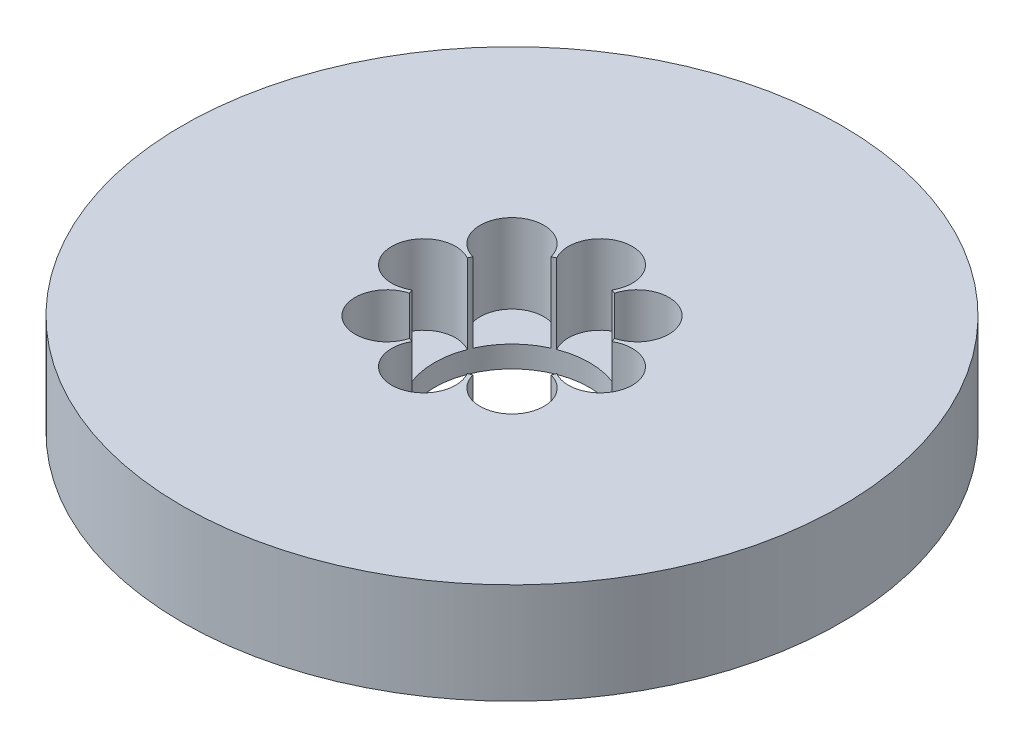
ISO-10303-21;
HEADER;
FILE_DESCRIPTION(('STEP AP214'),'2;1');
FILE_NAME('part.step','',(''),(''),'','','');
FILE_SCHEMA(('AUTOMOTIVE_DESIGN { 1 0 10303 214 1 1 1 1 }'));
ENDSEC;
DATA;
#1=APPLICATION_CONTEXT('core data for automotive mechanical design processes');
#2=APPLICATION_PROTOCOL_DEFINITION('international standard','automotive_design',2000,#1);
#3=PRODUCT_CONTEXT('',#1,'mechanical');
#4=PRODUCT('Part','Part','',(#3));
#5=PRODUCT_RELATED_PRODUCT_CATEGORY('part','',(#4));
#6=PRODUCT_DEFINITION_FORMATION('','',#4);
#7=PRODUCT_DEFINITION_CONTEXT('part definition',#1,'design');
#8=PRODUCT_DEFINITION('design','',#6,#7);
#9=PRODUCT_DEFINITION_SHAPE('','',#8);
#10=(LENGTH_UNIT() NAMED_UNIT(*) SI_UNIT(.MILLI.,.METRE.));
#11=(NAMED_UNIT(*) PLANE_ANGLE_UNIT() SI_UNIT($,.RADIAN.));
#12=(NAMED_UNIT(*) SI_UNIT($,.STERADIAN.) SOLID_ANGLE_UNIT());
#13=UNCERTAINTY_MEASURE_WITH_UNIT(LENGTH_MEASURE(1.E-05),#10,'distance_accuracy_value','');
#14=(GEOMETRIC_REPRESENTATION_CONTEXT(3) GLOBAL_UNCERTAINTY_ASSIGNED_CONTEXT((#13)) GLOBAL_UNIT_ASSIGNED_CONTEXT((#10,
#11,#12)) REPRESENTATION_CONTEXT('',''));
#15=CARTESIAN_POINT('',(0.,0.,0.));
#16=DIRECTION('',(0.,0.,1.));
#17=DIRECTION('',(1.,0.,0.));
#18=AXIS2_PLACEMENT_3D('',#15,#16,#17);
#19=CARTESIAN_POINT('',(0.,13.,0.));
#20=DIRECTION('',(0.,-1.,0.));
#21=DIRECTION('',(0.,0.,-1.));
#22=AXIS2_PLACEMENT_3D('',#19,#20,#21);
#23=CYLINDRICAL_SURFACE('',#22,42.5);
#24=CARTESIAN_POINT('',(0.,13.,0.));
#25=DIRECTION('',(0.,1.,0.));
#26=DIRECTION('',(0.,0.,1.));
#27=AXIS2_PLACEMENT_3D('',#24,#25,#26);
#28=CIRCLE('',#27,42.5);
#29=CARTESIAN_POINT('',(0.,13.,-42.5));
#30=VERTEX_POINT('',#29);
#31=EDGE_CURVE('E194',#30,#30,#28,.T.);
#32=CARTESIAN_POINT('',(0.,0.,0.));
#33=DIRECTION('',(0.,1.,0.));
#34=DIRECTION('',(0.,0.,1.));
#35=AXIS2_PLACEMENT_3D('',#32,#33,#34);
#36=CIRCLE('',#35,42.5);
#37=CARTESIAN_POINT('',(0.,0.,-42.5));
#38=VERTEX_POINT('',#37);
#39=EDGE_CURVE('E181',#38,#38,#36,.T.);
#40=CARTESIAN_POINT('',(0.,13.,-42.5));
#41=CARTESIAN_POINT('',(0.,12.8645833333333,-42.5));
#42=CARTESIAN_POINT('',(0.,12.7291666666667,-42.5));
#43=CARTESIAN_POINT('',(0.,12.4583333333333,-42.5));
#44=CARTESIAN_POINT('',(0.,12.3229166666667,-42.5));
#45=CARTESIAN_POINT('',(0.,12.0520833333333,-42.5));
#46=CARTESIAN_POINT('',(0.,11.9166666666667,-42.5));
#47=CARTESIAN_POINT('',(0.,11.6458333333333,-42.5));
#48=CARTESIAN_POINT('',(0.,11.5104166666667,-42.5));
#49=CARTESIAN_POINT('',(0.,11.2395833333333,-42.5));
#50=CARTESIAN_POINT('',(0.,11.1041666666667,-42.5));
#51=CARTESIAN_POINT('',(0.,10.8333333333333,-42.5));
#52=CARTESIAN_POINT('',(0.,10.6979166666667,-42.5));
#53=CARTESIAN_POINT('',(0.,10.4270833333333,-42.5));
#54=CARTESIAN_POINT('',(0.,10.2916666666667,-42.5));
#55=CARTESIAN_POINT('',(0.,10.0208333333333,-42.5));
#56=CARTESIAN_POINT('',(0.,9.88541666666667,-42.5));
#57=CARTESIAN_POINT('',(0.,9.61458333333333,-42.5));
#58=CARTESIAN_POINT('',(0.,9.47916666666667,-42.5));
#59=CARTESIAN_POINT('',(0.,9.20833333333333,-42.5));
#60=CARTESIAN_POINT('',(0.,9.07291666666666,-42.5));
#61=CARTESIAN_POINT('',(0.,8.80208333333333,-42.5));
#62=CARTESIAN_POINT('',(0.,8.66666666666667,-42.5));
#63=CARTESIAN_POINT('',(0.,8.39583333333333,-42.5));
#64=CARTESIAN_POINT('',(0.,8.26041666666667,-42.5));
#65=CARTESIAN_POINT('',(0.,7.98958333333333,-42.5));
#66=CARTESIAN_POINT('',(0.,7.85416666666667,-42.5));
#67=CARTESIAN_POINT('',(0.,7.58333333333333,-42.5));
#68=CARTESIAN_POINT('',(0.,7.44791666666667,-42.5));
#69=CARTESIAN_POINT('',(0.,7.17708333333333,-42.5));
#70=CARTESIAN_POINT('',(0.,7.04166666666667,-42.5));
#71=CARTESIAN_POINT('',(0.,6.77083333333333,-42.5));
#72=CARTESIAN_POINT('',(0.,6.63541666666667,-42.5));
#73=CARTESIAN_POINT('',(0.,6.36458333333333,-42.5));
#74=CARTESIAN_POINT('',(0.,6.22916666666667,-42.5));
#75=CARTESIAN_POINT('',(0.,5.95833333333333,-42.5));
#76=CARTESIAN_POINT('',(0.,5.82291666666667,-42.5));
#77=CARTESIAN_POINT('',(0.,5.55208333333333,-42.5));
#78=CARTESIAN_POINT('',(0.,5.41666666666667,-42.5));
#79=CARTESIAN_POINT('',(0.,5.14583333333333,-42.5));
#80=CARTESIAN_POINT('',(0.,5.01041666666667,-42.5));
#81=CARTESIAN_POINT('',(0.,4.73958333333333,-42.5));
#82=CARTESIAN_POINT('',(0.,4.60416666666667,-42.5));
#83=CARTESIAN_POINT('',(0.,4.33333333333333,-42.5));
#84=CARTESIAN_POINT('',(0.,4.19791666666667,-42.5));
#85=CARTESIAN_POINT('',(0.,3.92708333333333,-42.5));
#86=CARTESIAN_POINT('',(0.,3.79166666666667,-42.5));
#87=CARTESIAN_POINT('',(0.,3.52083333333333,-42.5));
#88=CARTESIAN_POINT('',(0.,3.38541666666667,-42.5));
#89=CARTESIAN_POINT('',(0.,3.11458333333333,-42.5));
#90=CARTESIAN_POINT('',(0.,2.97916666666667,-42.5));
#91=CARTESIAN_POINT('',(0.,2.70833333333333,-42.5));
#92=CARTESIAN_POINT('',(0.,2.57291666666667,-42.5));
#93=CARTESIAN_POINT('',(0.,2.30208333333333,-42.5));
#94=CARTESIAN_POINT('',(0.,2.16666666666667,-42.5));
#95=CARTESIAN_POINT('',(0.,1.89583333333333,-42.5));
#96=CARTESIAN_POINT('',(0.,1.76041666666667,-42.5));
#97=CARTESIAN_POINT('',(0.,1.48958333333333,-42.5));
#98=CARTESIAN_POINT('',(0.,1.35416666666667,-42.5));
#99=CARTESIAN_POINT('',(0.,1.08333333333333,-42.5));
#100=CARTESIAN_POINT('',(0.,0.947916666666667,-42.5));
#101=CARTESIAN_POINT('',(0.,0.677083333333334,-42.5));
#102=CARTESIAN_POINT('',(0.,0.541666666666667,-42.5));
#103=CARTESIAN_POINT('',(0.,0.270833333333334,-42.5));
#104=CARTESIAN_POINT('',(0.,0.135416666666667,-42.5));
#105=CARTESIAN_POINT('',(0.,0.,-42.5));
#106=B_SPLINE_CURVE_WITH_KNOTS('',3,(#40,#41,#42,#43,#44,#45,#46,#47,#48,#49,#50,#51,#52,#53,
#54,#55,#56,#57,#58,#59,#60,#61,#62,#63,#64,#65,#66,#67,#68,#69,#70,#71,#72,#73,#74,#75,#76,#77,
#78,#79,#80,#81,#82,#83,#84,#85,#86,#87,#88,#89,#90,#91,#92,#93,#94,#95,#96,#97,#98,#99,#100,
#101,#102,#103,#104,#105),.UNSPECIFIED.,.F.,.F.,(4,2,2,2,2,2,2,2,2,2,2,2,2,2,2,2,2,2,2,2,2,2,2,
2,2,2,2,2,2,2,2,2,4),(0.,0.40625,0.812500000000001,1.21875,1.625,2.03125,2.4375,2.84375,3.25,
3.65625,4.0625,4.46875,4.875,5.28125,5.6875,6.09375,6.5,6.90625,7.3125,7.71875,8.125,8.53125,
8.9375,9.34375,9.75,10.15625,10.5625,10.96875,11.375,11.78125,12.1875,12.59375,13.),.UNSPECIFIED.);
#107=EDGE_CURVE('BSEAM39',#30,#38,#106,.T.);
#108=ORIENTED_EDGE('',*,*,#31,.F.);
#109=ORIENTED_EDGE('',*,*,#39,.T.);
#110=ORIENTED_EDGE('',*,*,#107,.T.);
#111=ORIENTED_EDGE('',*,*,#107,.F.);
#112=EDGE_LOOP('',(#108,#110,#109,#111));
#113=FACE_BOUND('',#112,.T.);
#114=ADVANCED_FACE('F39',(#113),#23,.T.);
#115=CARTESIAN_POINT('',(0.,13.,0.));
#116=DIRECTION('',(0.,1.,0.));
#117=DIRECTION('',(0.,0.,1.));
#118=AXIS2_PLACEMENT_3D('',#115,#116,#117);
#119=PLANE('',#118);
#120=CARTESIAN_POINT('',(11.3924649321803,13.,0.));
#121=DIRECTION('',(0.,1.,0.));
#122=DIRECTION('',(0.,0.,-1.));
#123=AXIS2_PLACEMENT_3D('',#120,#121,#122);
#124=CIRCLE('',#123,4.11995132108615);
#125=CARTESIAN_POINT('',(9.34013225450894,13.,3.57238428339977));
#126=VERTEX_POINT('',#125);
#127=CARTESIAN_POINT('',(9.34013225450894,13.,-3.57238428339977));
#128=VERTEX_POINT('',#127);
#129=EDGE_CURVE('E254',#126,#128,#124,.T.);
#130=ORIENTED_EDGE('',*,*,#129,.F.);
#131=CARTESIAN_POINT('',(0.,13.,0.));
#132=DIRECTION('',(0.,1.,0.));
#133=DIRECTION('',(0.,0.,1.));
#134=AXIS2_PLACEMENT_3D('',#131,#132,#133);
#135=CIRCLE('',#134,10.);
#136=CARTESIAN_POINT('',(9.13052800613871,13.,4.0784137025462));
#137=VERTEX_POINT('',#136);
#138=EDGE_CURVE('E186',#137,#126,#135,.T.);
#139=ORIENTED_EDGE('',*,*,#138,.F.);
#140=CARTESIAN_POINT('',(8.05568920797469,13.,8.05568920797461));
#141=DIRECTION('',(0.,1.,0.));
#142=DIRECTION('',(0.707106781186544,0.,-0.707106781186551));
#143=AXIS2_PLACEMENT_3D('',#140,#141,#142);
#144=CIRCLE('',#143,4.11995132108615);
#145=CARTESIAN_POINT('',(4.0784137025463,13.,9.13052800613867));
#146=VERTEX_POINT('',#145);
#147=EDGE_CURVE('E323',#146,#137,#144,.T.);
#148=ORIENTED_EDGE('',*,*,#147,.F.);
#149=CARTESIAN_POINT('',(3.5723842833998,13.,9.34013225450893));
#150=VERTEX_POINT('',#149);
#151=EDGE_CURVE('E182',#150,#146,#135,.T.);
#152=ORIENTED_EDGE('',*,*,#151,.F.);
#153=CARTESIAN_POINT('',(0.,13.,11.3924649321803));
#154=DIRECTION('',(0.,1.,0.));
#155=DIRECTION('',(1.,0.,0.));
#156=AXIS2_PLACEMENT_3D('',#153,#154,#155);
#157=CIRCLE('',#156,4.11995132108615);
#158=CARTESIAN_POINT('',(-3.57238428339974,13.,9.34013225450895));
#159=VERTEX_POINT('',#158);
#160=EDGE_CURVE('E178',#159,#150,#157,.T.);
#161=ORIENTED_EDGE('',*,*,#160,.F.);
#162=CARTESIAN_POINT('',(-4.07841370254623,13.,9.1305280061387));
#163=VERTEX_POINT('',#162);
#164=EDGE_CURVE('E171',#163,#159,#135,.T.);
#165=ORIENTED_EDGE('',*,*,#164,.F.);
#166=CARTESIAN_POINT('',(-8.05568920797464,13.,8.05568920797466));
#167=DIRECTION('',(0.,1.,0.));
#168=DIRECTION('',(0.707106781186549,0.,0.707106781186546));
#169=AXIS2_PLACEMENT_3D('',#166,#167,#168);
#170=CIRCLE('',#169,4.11995132108615);
#171=CARTESIAN_POINT('',(-9.13052800613869,13.,4.07841370254626));
#172=VERTEX_POINT('',#171);
#173=EDGE_CURVE('E147',#172,#163,#170,.T.);
#174=ORIENTED_EDGE('',*,*,#173,.F.);
#175=CARTESIAN_POINT('',(-9.34013225450894,13.,3.57238428339977));
#176=VERTEX_POINT('',#175);
#177=EDGE_CURVE('E179',#176,#172,#135,.T.);
#178=ORIENTED_EDGE('',*,*,#177,.F.);
#179=CARTESIAN_POINT('',(-11.3924649321803,13.,0.));
#180=DIRECTION('',(0.,1.,0.));
#181=DIRECTION('',(0.,0.,1.));
#182=AXIS2_PLACEMENT_3D('',#179,#180,#181);
#183=CIRCLE('',#182,4.11995132108615);
#184=CARTESIAN_POINT('',(-9.34013225450894,13.,-3.57238428339977));
#185=VERTEX_POINT('',#184);
#186=EDGE_CURVE('E188',#185,#176,#183,.T.);
#187=ORIENTED_EDGE('',*,*,#186,.F.);
#188=CARTESIAN_POINT('',(-9.13052800613874,13.,-4.07841370254614));
#189=VERTEX_POINT('',#188);
#190=EDGE_CURVE('E184',#189,#185,#135,.T.);
#191=ORIENTED_EDGE('',*,*,#190,.F.);
#192=CARTESIAN_POINT('',(-8.05568920797475,13.,-8.05568920797455));
#193=DIRECTION('',(0.,1.,0.));
#194=DIRECTION('',(-0.707106781186539,0.,0.707106781186556));
#195=AXIS2_PLACEMENT_3D('',#192,#193,#194);
#196=CIRCLE('',#195,4.11995132108615);
#197=CARTESIAN_POINT('',(-4.07841370254636,13.,-9.13052800613864));
#198=VERTEX_POINT('',#197);
#199=EDGE_CURVE('E368',#198,#189,#196,.T.);
#200=ORIENTED_EDGE('',*,*,#199,.F.);
#201=CARTESIAN_POINT('',(-3.57238428339987,13.,-9.34013225450891));
#202=VERTEX_POINT('',#201);
#203=EDGE_CURVE('E345',#202,#198,#135,.T.);
#204=ORIENTED_EDGE('',*,*,#203,.F.);
#205=CARTESIAN_POINT('',(-1.19329736142397E-13,13.,-11.3924649321803));
#206=DIRECTION('',(0.,1.,0.));
#207=DIRECTION('',(-1.,0.,0.));
#208=AXIS2_PLACEMENT_3D('',#205,#206,#207);
#209=CIRCLE('',#208,4.11995132108615);
#210=CARTESIAN_POINT('',(3.57238428339967,13.,-9.34013225450898));
#211=VERTEX_POINT('',#210);
#212=EDGE_CURVE('E363',#211,#202,#209,.T.);
#213=ORIENTED_EDGE('',*,*,#212,.F.);
#214=CARTESIAN_POINT('',(4.07841370254617,13.,-9.13052800613873));
#215=VERTEX_POINT('',#214);
#216=EDGE_CURVE('E343',#215,#211,#135,.T.);
#217=ORIENTED_EDGE('',*,*,#216,.F.);
#218=CARTESIAN_POINT('',(8.05568920797458,13.,-8.05568920797472));
#219=DIRECTION('',(0.,1.,0.));
#220=DIRECTION('',(-0.707106781186554,0.,-0.707106781186541));
#221=AXIS2_PLACEMENT_3D('',#218,#219,#220);
#222=CIRCLE('',#221,4.11995132108615);
#223=CARTESIAN_POINT('',(9.13052800613866,13.,-4.07841370254633));
#224=VERTEX_POINT('',#223);
#225=EDGE_CURVE('E354',#224,#215,#222,.T.);
#226=ORIENTED_EDGE('',*,*,#225,.F.);
#227=EDGE_CURVE('E349',#128,#224,#135,.T.);
#228=ORIENTED_EDGE('',*,*,#227,.F.);
#229=EDGE_LOOP('',(#130,#139,#148,#152,#161,#165,#174,#178,#187,#191,#200,#204,#213,#217,#226,#228));
#230=FACE_BOUND('',#229,.T.);
#231=ORIENTED_EDGE('',*,*,#31,.T.);
#232=EDGE_LOOP('',(#231));
#233=FACE_BOUND('',#232,.T.);
#234=ADVANCED_FACE('F176',(#230,#233),#119,.T.);
#235=CARTESIAN_POINT('',(0.,0.,0.));
#236=DIRECTION('',(0.,1.,0.));
#237=DIRECTION('',(0.,0.,1.));
#238=AXIS2_PLACEMENT_3D('',#235,#236,#237);
#239=PLANE('',#238);
#240=CARTESIAN_POINT('',(0.,0.,0.));
#241=DIRECTION('',(0.,1.,0.));
#242=DIRECTION('',(0.,0.,1.));
#243=AXIS2_PLACEMENT_3D('',#240,#241,#242);
#244=CIRCLE('',#243,10.);
#245=CARTESIAN_POINT('',(0.,0.,10.));
#246=VERTEX_POINT('',#245);
#247=EDGE_CURVE('E191',#246,#246,#244,.T.);
#248=ORIENTED_EDGE('',*,*,#247,.T.);
#249=EDGE_LOOP('',(#248));
#250=FACE_BOUND('',#249,.T.);
#251=ORIENTED_EDGE('',*,*,#39,.F.);
#252=EDGE_LOOP('',(#251));
#253=FACE_BOUND('',#252,.T.);
#254=ADVANCED_FACE('F273',(#250,#253),#239,.F.);
#255=CARTESIAN_POINT('',(0.,13.,0.));
#256=DIRECTION('',(0.,-1.,0.));
#257=DIRECTION('',(0.,0.,-1.));
#258=AXIS2_PLACEMENT_3D('',#255,#256,#257);
#259=CYLINDRICAL_SURFACE('',#258,10.);
#260=DIRECTION('',(0.,1.,0.));
#261=VECTOR('',#260,1.);
#262=CARTESIAN_POINT('',(9.34013225450894,7.89036313454172,3.57238428339977));
#263=LINE('',#262,#261);
#264=CARTESIAN_POINT('',(9.34013225450894,2.78072626908345,3.57238428339977));
#265=VERTEX_POINT('',#264);
#266=EDGE_CURVE('E11',#265,#126,#263,.T.);
#267=ORIENTED_EDGE('',*,*,#266,.F.);
#268=CARTESIAN_POINT('',(0.,2.78072626908345,0.));
#269=DIRECTION('',(0.,1.,0.));
#270=DIRECTION('',(0.,0.,1.));
#271=AXIS2_PLACEMENT_3D('',#268,#269,#270);
#272=CIRCLE('',#271,10.);
#273=CARTESIAN_POINT('',(9.34013225450894,2.78072626908345,-3.57238428339977));
#274=VERTEX_POINT('',#273);
#275=EDGE_CURVE('E249',#265,#274,#272,.T.);
#276=ORIENTED_EDGE('',*,*,#275,.T.);
#277=DIRECTION('',(0.,1.,0.));
#278=VECTOR('',#277,1.);
#279=CARTESIAN_POINT('',(9.34013225450894,7.89036313454172,-3.57238428339977));
#280=LINE('',#279,#278);
#281=EDGE_CURVE('E46',#128,#274,#280,.F.);
#282=ORIENTED_EDGE('',*,*,#281,.F.);
#283=ORIENTED_EDGE('',*,*,#227,.T.);
#284=DIRECTION('',(0.,1.,0.));
#285=VECTOR('',#284,1.);
#286=CARTESIAN_POINT('',(9.13052800613866,7.89036313454172,-4.07841370254633));
#287=LINE('',#286,#285);
#288=CARTESIAN_POINT('',(9.13052800613866,2.78072626908345,-4.07841370254633));
#289=VERTEX_POINT('',#288);
#290=EDGE_CURVE('E247',#289,#224,#287,.T.);
#291=ORIENTED_EDGE('',*,*,#290,.F.);
#292=CARTESIAN_POINT('',(0.,2.78072626908345,0.));
#293=DIRECTION('',(0.,1.,0.));
#294=DIRECTION('',(0.,0.,1.));
#295=AXIS2_PLACEMENT_3D('',#292,#293,#294);
#296=CIRCLE('',#295,10.);
#297=CARTESIAN_POINT('',(4.07841370254617,2.78072626908345,-9.13052800613873));
#298=VERTEX_POINT('',#297);
#299=EDGE_CURVE('E242',#289,#298,#296,.T.);
#300=ORIENTED_EDGE('',*,*,#299,.T.);
#301=DIRECTION('',(0.,1.,0.));
#302=VECTOR('',#301,1.);
#303=CARTESIAN_POINT('',(4.07841370254617,7.89036313454172,-9.13052800613873));
#304=LINE('',#303,#302);
#305=EDGE_CURVE('E246',#215,#298,#304,.F.);
#306=ORIENTED_EDGE('',*,*,#305,.F.);
#307=ORIENTED_EDGE('',*,*,#216,.T.);
#308=DIRECTION('',(0.,1.,0.));
#309=VECTOR('',#308,1.);
#310=CARTESIAN_POINT('',(3.57238428339967,7.89036313454172,-9.34013225450898));
#311=LINE('',#310,#309);
#312=CARTESIAN_POINT('',(3.57238428339967,2.78072626908345,-9.34013225450898));
#313=VERTEX_POINT('',#312);
#314=EDGE_CURVE('E220',#313,#211,#311,.T.);
#315=ORIENTED_EDGE('',*,*,#314,.F.);
#316=CARTESIAN_POINT('',(0.,2.78072626908345,0.));
#317=DIRECTION('',(0.,1.,0.));
#318=DIRECTION('',(0.,0.,1.));
#319=AXIS2_PLACEMENT_3D('',#316,#317,#318);
#320=CIRCLE('',#319,10.);
#321=CARTESIAN_POINT('',(-3.57238428339987,2.78072626908345,-9.34013225450891));
#322=VERTEX_POINT('',#321);
#323=EDGE_CURVE('E211',#313,#322,#320,.T.);
#324=ORIENTED_EDGE('',*,*,#323,.T.);
#325=DIRECTION('',(0.,1.,0.));
#326=VECTOR('',#325,1.);
#327=CARTESIAN_POINT('',(-3.57238428339987,7.89036313454172,-9.34013225450891));
#328=LINE('',#327,#326);
#329=EDGE_CURVE('E212',#202,#322,#328,.F.);
#330=ORIENTED_EDGE('',*,*,#329,.F.);
#331=ORIENTED_EDGE('',*,*,#203,.T.);
#332=DIRECTION('',(0.,1.,0.));
#333=VECTOR('',#332,1.);
#334=CARTESIAN_POINT('',(-4.07841370254636,7.89036313454172,-9.13052800613864));
#335=LINE('',#334,#333);
#336=CARTESIAN_POINT('',(-4.07841370254636,2.78072626908345,-9.13052800613864));
#337=VERTEX_POINT('',#336);
#338=EDGE_CURVE('E223',#337,#198,#335,.T.);
#339=ORIENTED_EDGE('',*,*,#338,.F.);
#340=CARTESIAN_POINT('',(0.,2.78072626908345,0.));
#341=DIRECTION('',(0.,1.,0.));
#342=DIRECTION('',(0.,0.,1.));
#343=AXIS2_PLACEMENT_3D('',#340,#341,#342);
#344=CIRCLE('',#343,10.);
#345=CARTESIAN_POINT('',(-9.13052800613874,2.78072626908345,-4.07841370254614));
#346=VERTEX_POINT('',#345);
#347=EDGE_CURVE('E218',#337,#346,#344,.T.);
#348=ORIENTED_EDGE('',*,*,#347,.T.);
#349=DIRECTION('',(0.,1.,0.));
#350=VECTOR('',#349,1.);
#351=CARTESIAN_POINT('',(-9.13052800613874,7.89036313454172,-4.07841370254614));
#352=LINE('',#351,#350);
#353=EDGE_CURVE('E225',#189,#346,#352,.F.);
#354=ORIENTED_EDGE('',*,*,#353,.F.);
#355=ORIENTED_EDGE('',*,*,#190,.T.);
#356=DIRECTION('',(0.,1.,0.));
#357=VECTOR('',#356,1.);
#358=CARTESIAN_POINT('',(-9.34013225450894,7.89036313454172,-3.57238428339977));
#359=LINE('',#358,#357);
#360=CARTESIAN_POINT('',(-9.34013225450894,2.78072626908345,-3.57238428339977));
#361=VERTEX_POINT('',#360);
#362=EDGE_CURVE('E206',#361,#185,#359,.T.);
#363=ORIENTED_EDGE('',*,*,#362,.F.);
#364=CARTESIAN_POINT('',(0.,2.78072626908345,0.));
#365=DIRECTION('',(0.,1.,0.));
#366=DIRECTION('',(0.,0.,1.));
#367=AXIS2_PLACEMENT_3D('',#364,#365,#366);
#368=CIRCLE('',#367,10.);
#369=CARTESIAN_POINT('',(-9.34013225450894,2.78072626908345,3.57238428339977));
#370=VERTEX_POINT('',#369);
#371=EDGE_CURVE('E196',#361,#370,#368,.T.);
#372=ORIENTED_EDGE('',*,*,#371,.T.);
#373=DIRECTION('',(0.,1.,0.));
#374=VECTOR('',#373,1.);
#375=CARTESIAN_POINT('',(-9.34013225450894,7.89036313454172,3.57238428339977));
#376=LINE('',#375,#374);
#377=EDGE_CURVE('E201',#176,#370,#376,.F.);
#378=ORIENTED_EDGE('',*,*,#377,.F.);
#379=ORIENTED_EDGE('',*,*,#177,.T.);
#380=DIRECTION('',(0.,1.,0.));
#381=VECTOR('',#380,1.);
#382=CARTESIAN_POINT('',(-9.13052800613869,7.89036313454172,4.07841370254627));
#383=LINE('',#382,#381);
#384=CARTESIAN_POINT('',(-9.13052800613869,2.78072626908345,4.07841370254626));
#385=VERTEX_POINT('',#384);
#386=EDGE_CURVE('E160',#385,#172,#383,.T.);
#387=ORIENTED_EDGE('',*,*,#386,.F.);
#388=CARTESIAN_POINT('',(0.,2.78072626908345,0.));
#389=DIRECTION('',(0.,1.,0.));
#390=DIRECTION('',(0.,0.,1.));
#391=AXIS2_PLACEMENT_3D('',#388,#389,#390);
#392=CIRCLE('',#391,10.);
#393=CARTESIAN_POINT('',(-4.07841370254623,2.78072626908345,9.1305280061387));
#394=VERTEX_POINT('',#393);
#395=EDGE_CURVE('E175',#385,#394,#392,.T.);
#396=ORIENTED_EDGE('',*,*,#395,.T.);
#397=DIRECTION('',(0.,1.,0.));
#398=VECTOR('',#397,1.);
#399=CARTESIAN_POINT('',(-4.07841370254623,7.89036313454172,9.1305280061387));
#400=LINE('',#399,#398);
#401=EDGE_CURVE('E152',#163,#394,#400,.F.);
#402=ORIENTED_EDGE('',*,*,#401,.F.);
#403=ORIENTED_EDGE('',*,*,#164,.T.);
#404=DIRECTION('',(0.,1.,0.));
#405=VECTOR('',#404,1.);
#406=CARTESIAN_POINT('',(-3.57238428339974,7.89036313454172,9.34013225450896));
#407=LINE('',#406,#405);
#408=CARTESIAN_POINT('',(-3.57238428339974,2.78072626908345,9.34013225450895));
#409=VERTEX_POINT('',#408);
#410=EDGE_CURVE('E241',#409,#159,#407,.T.);
#411=ORIENTED_EDGE('',*,*,#410,.F.);
#412=CARTESIAN_POINT('',(0.,2.78072626908345,0.));
#413=DIRECTION('',(0.,1.,0.));
#414=DIRECTION('',(0.,0.,1.));
#415=AXIS2_PLACEMENT_3D('',#412,#413,#414);
#416=CIRCLE('',#415,10.);
#417=CARTESIAN_POINT('',(3.5723842833998,2.78072626908345,9.34013225450893));
#418=VERTEX_POINT('',#417);
#419=EDGE_CURVE('E234',#409,#418,#416,.T.);
#420=ORIENTED_EDGE('',*,*,#419,.T.);
#421=DIRECTION('',(0.,1.,0.));
#422=VECTOR('',#421,1.);
#423=CARTESIAN_POINT('',(3.5723842833998,7.89036313454172,9.34013225450893));
#424=LINE('',#423,#422);
#425=EDGE_CURVE('E236',#150,#418,#424,.F.);
#426=ORIENTED_EDGE('',*,*,#425,.F.);
#427=ORIENTED_EDGE('',*,*,#151,.T.);
#428=DIRECTION('',(0.,1.,0.));
#429=VECTOR('',#428,1.);
#430=CARTESIAN_POINT('',(4.0784137025463,7.89036313454172,9.13052800613867));
#431=LINE('',#430,#429);
#432=CARTESIAN_POINT('',(4.0784137025463,2.78072626908345,9.13052800613867));
#433=VERTEX_POINT('',#432);
#434=EDGE_CURVE('E232',#433,#146,#431,.T.);
#435=ORIENTED_EDGE('',*,*,#434,.F.);
#436=CARTESIAN_POINT('',(0.,2.78072626908345,0.));
#437=DIRECTION('',(0.,1.,0.));
#438=DIRECTION('',(0.,0.,1.));
#439=AXIS2_PLACEMENT_3D('',#436,#437,#438);
#440=CIRCLE('',#439,10.);
#441=CARTESIAN_POINT('',(9.13052800613871,2.78072626908345,4.0784137025462));
#442=VERTEX_POINT('',#441);
#443=EDGE_CURVE('E230',#433,#442,#440,.T.);
#444=ORIENTED_EDGE('',*,*,#443,.T.);
#445=DIRECTION('',(0.,1.,0.));
#446=VECTOR('',#445,1.);
#447=CARTESIAN_POINT('',(9.13052800613871,7.89036313454172,4.0784137025462));
#448=LINE('',#447,#446);
#449=EDGE_CURVE('E229',#137,#442,#448,.F.);
#450=ORIENTED_EDGE('',*,*,#449,.F.);
#451=ORIENTED_EDGE('',*,*,#138,.T.);
#452=EDGE_LOOP('',(#267,#276,#282,#283,#291,#300,#306,#307,#315,#324,#330,#331,#339,#348,#354,
#355,#363,#372,#378,#379,#387,#396,#402,#403,#411,#420,#426,#427,#435,#444,#450,#451));
#453=FACE_BOUND('',#452,.T.);
#454=ORIENTED_EDGE('',*,*,#247,.F.);
#455=EDGE_LOOP('',(#454));
#456=FACE_BOUND('',#455,.T.);
#457=ADVANCED_FACE('F169',(#453,#456),#259,.F.);
#458=CARTESIAN_POINT('',(-11.3924649321803,2.78072626908345,0.));
#459=DIRECTION('',(0.,1.,0.));
#460=DIRECTION('',(0.,0.,1.));
#461=AXIS2_PLACEMENT_3D('',#458,#459,#460);
#462=CYLINDRICAL_SURFACE('',#461,4.11995132108615);
#463=ORIENTED_EDGE('',*,*,#362,.T.);
#464=ORIENTED_EDGE('',*,*,#186,.T.);
#465=ORIENTED_EDGE('',*,*,#377,.T.);
#466=CARTESIAN_POINT('',(-11.3924649321803,2.78072626908345,0.));
#467=DIRECTION('',(0.,1.,0.));
#468=DIRECTION('',(0.,0.,1.));
#469=AXIS2_PLACEMENT_3D('',#466,#467,#468);
#470=CIRCLE('',#469,4.11995132108615);
#471=EDGE_CURVE('E193',#361,#370,#470,.T.);
#472=ORIENTED_EDGE('',*,*,#471,.F.);
#473=EDGE_LOOP('',(#463,#464,#465,#472));
#474=FACE_BOUND('',#473,.T.);
#475=ADVANCED_FACE('F284',(#474),#462,.F.);
#476=CARTESIAN_POINT('',(-11.3924649321803,2.78072626908345,0.));
#477=DIRECTION('',(0.,1.,0.));
#478=DIRECTION('',(0.,0.,1.));
#479=AXIS2_PLACEMENT_3D('',#476,#477,#478);
#480=PLANE('',#479);
#481=ORIENTED_EDGE('',*,*,#471,.T.);
#482=ORIENTED_EDGE('',*,*,#371,.F.);
#483=EDGE_LOOP('',(#481,#482));
#484=FACE_BOUND('',#483,.T.);
#485=ADVANCED_FACE('F288',(#484),#480,.T.);
#486=CARTESIAN_POINT('',(-8.05568920797464,2.78072626908345,8.05568920797466));
#487=DIRECTION('',(0.,1.,0.));
#488=DIRECTION('',(0.,0.,1.));
#489=AXIS2_PLACEMENT_3D('',#486,#487,#488);
#490=CYLINDRICAL_SURFACE('',#489,4.11995132108615);
#491=ORIENTED_EDGE('',*,*,#386,.T.);
#492=ORIENTED_EDGE('',*,*,#173,.T.);
#493=ORIENTED_EDGE('',*,*,#401,.T.);
#494=CARTESIAN_POINT('',(-8.05568920797464,2.78072626908345,8.05568920797466));
#495=DIRECTION('',(0.,1.,0.));
#496=DIRECTION('',(0.707106781186549,0.,0.707106781186546));
#497=AXIS2_PLACEMENT_3D('',#494,#495,#496);
#498=CIRCLE('',#497,4.11995132108615);
#499=EDGE_CURVE('E165',#385,#394,#498,.T.);
#500=ORIENTED_EDGE('',*,*,#499,.F.);
#501=EDGE_LOOP('',(#491,#492,#493,#500));
#502=FACE_BOUND('',#501,.T.);
#503=ADVANCED_FACE('F155',(#502),#490,.F.);
#504=CARTESIAN_POINT('',(-8.05568920797464,2.78072626908345,8.05568920797466));
#505=DIRECTION('',(0.,1.,0.));
#506=DIRECTION('',(0.707106781186549,0.,0.707106781186546));
#507=AXIS2_PLACEMENT_3D('',#504,#505,#506);
#508=PLANE('',#507);
#509=ORIENTED_EDGE('',*,*,#499,.T.);
#510=ORIENTED_EDGE('',*,*,#395,.F.);
#511=EDGE_LOOP('',(#509,#510));
#512=FACE_BOUND('',#511,.T.);
#513=ADVANCED_FACE('F296',(#512),#508,.T.);
#514=CARTESIAN_POINT('',(-1.19329736142397E-13,2.78072626908345,-11.3924649321803));
#515=DIRECTION('',(0.,1.,0.));
#516=DIRECTION('',(0.,0.,1.));
#517=AXIS2_PLACEMENT_3D('',#514,#515,#516);
#518=CYLINDRICAL_SURFACE('',#517,4.11995132108615);
#519=ORIENTED_EDGE('',*,*,#314,.T.);
#520=ORIENTED_EDGE('',*,*,#212,.T.);
#521=ORIENTED_EDGE('',*,*,#329,.T.);
#522=CARTESIAN_POINT('',(-1.19329736142397E-13,2.78072626908345,-11.3924649321803));
#523=DIRECTION('',(0.,1.,0.));
#524=DIRECTION('',(-1.,0.,0.));
#525=AXIS2_PLACEMENT_3D('',#522,#523,#524);
#526=CIRCLE('',#525,4.11995132108615);
#527=EDGE_CURVE('E357',#313,#322,#526,.T.);
#528=ORIENTED_EDGE('',*,*,#527,.F.);
#529=EDGE_LOOP('',(#519,#520,#521,#528));
#530=FACE_BOUND('',#529,.T.);
#531=ADVANCED_FACE('F298',(#530),#518,.F.);
#532=CARTESIAN_POINT('',(-1.19329736142397E-13,2.78072626908345,-11.3924649321803));
#533=DIRECTION('',(0.,1.,0.));
#534=DIRECTION('',(-1.,0.,0.));
#535=AXIS2_PLACEMENT_3D('',#532,#533,#534);
#536=PLANE('',#535);
#537=ORIENTED_EDGE('',*,*,#527,.T.);
#538=ORIENTED_EDGE('',*,*,#323,.F.);
#539=EDGE_LOOP('',(#537,#538));
#540=FACE_BOUND('',#539,.T.);
#541=ADVANCED_FACE('F374',(#540),#536,.T.);
#542=CARTESIAN_POINT('',(-8.05568920797475,2.78072626908345,-8.05568920797455));
#543=DIRECTION('',(0.,1.,0.));
#544=DIRECTION('',(0.,0.,1.));
#545=AXIS2_PLACEMENT_3D('',#542,#543,#544);
#546=CYLINDRICAL_SURFACE('',#545,4.11995132108615);
#547=ORIENTED_EDGE('',*,*,#338,.T.);
#548=ORIENTED_EDGE('',*,*,#199,.T.);
#549=ORIENTED_EDGE('',*,*,#353,.T.);
#550=CARTESIAN_POINT('',(-8.05568920797475,2.78072626908345,-8.05568920797455));
#551=DIRECTION('',(0.,1.,0.));
#552=DIRECTION('',(-0.707106781186539,0.,0.707106781186556));
#553=AXIS2_PLACEMENT_3D('',#550,#551,#552);
#554=CIRCLE('',#553,4.11995132108615);
#555=EDGE_CURVE('E365',#337,#346,#554,.T.);
#556=ORIENTED_EDGE('',*,*,#555,.F.);
#557=EDGE_LOOP('',(#547,#548,#549,#556));
#558=FACE_BOUND('',#557,.T.);
#559=ADVANCED_FACE('F371',(#558),#546,.F.);
#560=CARTESIAN_POINT('',(-8.05568920797475,2.78072626908345,-8.05568920797455));
#561=DIRECTION('',(0.,1.,0.));
#562=DIRECTION('',(-0.707106781186539,0.,0.707106781186556));
#563=AXIS2_PLACEMENT_3D('',#560,#561,#562);
#564=PLANE('',#563);
#565=ORIENTED_EDGE('',*,*,#555,.T.);
#566=ORIENTED_EDGE('',*,*,#347,.F.);
#567=EDGE_LOOP('',(#565,#566));
#568=FACE_BOUND('',#567,.T.);
#569=ADVANCED_FACE('F314',(#568),#564,.T.);
#570=CARTESIAN_POINT('',(8.05568920797469,2.78072626908345,8.05568920797461));
#571=DIRECTION('',(0.,1.,0.));
#572=DIRECTION('',(0.,0.,1.));
#573=AXIS2_PLACEMENT_3D('',#570,#571,#572);
#574=CYLINDRICAL_SURFACE('',#573,4.11995132108615);
#575=ORIENTED_EDGE('',*,*,#434,.T.);
#576=ORIENTED_EDGE('',*,*,#147,.T.);
#577=ORIENTED_EDGE('',*,*,#449,.T.);
#578=CARTESIAN_POINT('',(8.05568920797469,2.78072626908345,8.05568920797461));
#579=DIRECTION('',(0.,1.,0.));
#580=DIRECTION('',(0.707106781186544,0.,-0.707106781186551));
#581=AXIS2_PLACEMENT_3D('',#578,#579,#580);
#582=CIRCLE('',#581,4.11995132108615);
#583=EDGE_CURVE('E321',#433,#442,#582,.T.);
#584=ORIENTED_EDGE('',*,*,#583,.F.);
#585=EDGE_LOOP('',(#575,#576,#577,#584));
#586=FACE_BOUND('',#585,.T.);
#587=ADVANCED_FACE('F313',(#586),#574,.F.);
#588=CARTESIAN_POINT('',(8.05568920797469,2.78072626908345,8.05568920797461));
#589=DIRECTION('',(0.,1.,0.));
#590=DIRECTION('',(0.707106781186544,0.,-0.707106781186551));
#591=AXIS2_PLACEMENT_3D('',#588,#589,#590);
#592=PLANE('',#591);
#593=ORIENTED_EDGE('',*,*,#583,.T.);
#594=ORIENTED_EDGE('',*,*,#443,.F.);
#595=EDGE_LOOP('',(#593,#594));
#596=FACE_BOUND('',#595,.T.);
#597=ADVANCED_FACE('F304',(#596),#592,.T.);
#598=CARTESIAN_POINT('',(0.,2.78072626908345,11.3924649321803));
#599=DIRECTION('',(0.,1.,0.));
#600=DIRECTION('',(0.,0.,1.));
#601=AXIS2_PLACEMENT_3D('',#598,#599,#600);
#602=CYLINDRICAL_SURFACE('',#601,4.11995132108615);
#603=ORIENTED_EDGE('',*,*,#410,.T.);
#604=ORIENTED_EDGE('',*,*,#160,.T.);
#605=ORIENTED_EDGE('',*,*,#425,.T.);
#606=CARTESIAN_POINT('',(0.,2.78072626908345,11.3924649321803));
#607=DIRECTION('',(0.,1.,0.));
#608=DIRECTION('',(1.,0.,0.));
#609=AXIS2_PLACEMENT_3D('',#606,#607,#608);
#610=CIRCLE('',#609,4.11995132108615);
#611=EDGE_CURVE('E162',#409,#418,#610,.T.);
#612=ORIENTED_EDGE('',*,*,#611,.F.);
#613=EDGE_LOOP('',(#603,#604,#605,#612));
#614=FACE_BOUND('',#613,.T.);
#615=ADVANCED_FACE('F301',(#614),#602,.F.);
#616=CARTESIAN_POINT('',(0.,2.78072626908345,11.3924649321803));
#617=DIRECTION('',(0.,1.,0.));
#618=DIRECTION('',(1.,0.,0.));
#619=AXIS2_PLACEMENT_3D('',#616,#617,#618);
#620=PLANE('',#619);
#621=ORIENTED_EDGE('',*,*,#611,.T.);
#622=ORIENTED_EDGE('',*,*,#419,.F.);
#623=EDGE_LOOP('',(#621,#622));
#624=FACE_BOUND('',#623,.T.);
#625=ADVANCED_FACE('F303',(#624),#620,.T.);
#626=CARTESIAN_POINT('',(8.05568920797458,2.78072626908345,-8.05568920797472));
#627=DIRECTION('',(0.,1.,0.));
#628=DIRECTION('',(0.,0.,1.));
#629=AXIS2_PLACEMENT_3D('',#626,#627,#628);
#630=CYLINDRICAL_SURFACE('',#629,4.11995132108615);
#631=ORIENTED_EDGE('',*,*,#290,.T.);
#632=ORIENTED_EDGE('',*,*,#225,.T.);
#633=ORIENTED_EDGE('',*,*,#305,.T.);
#634=CARTESIAN_POINT('',(8.05568920797458,2.78072626908345,-8.05568920797472));
#635=DIRECTION('',(0.,1.,0.));
#636=DIRECTION('',(-0.707106781186554,0.,-0.707106781186541));
#637=AXIS2_PLACEMENT_3D('',#634,#635,#636);
#638=CIRCLE('',#637,4.11995132108615);
#639=EDGE_CURVE('E56',#289,#298,#638,.T.);
#640=ORIENTED_EDGE('',*,*,#639,.F.);
#641=EDGE_LOOP('',(#631,#632,#633,#640));
#642=FACE_BOUND('',#641,.T.);
#643=ADVANCED_FACE('F310',(#642),#630,.F.);
#644=CARTESIAN_POINT('',(8.05568920797458,2.78072626908345,-8.05568920797472));
#645=DIRECTION('',(0.,1.,0.));
#646=DIRECTION('',(-0.707106781186554,0.,-0.707106781186541));
#647=AXIS2_PLACEMENT_3D('',#644,#645,#646);
#648=PLANE('',#647);
#649=ORIENTED_EDGE('',*,*,#639,.T.);
#650=ORIENTED_EDGE('',*,*,#299,.F.);
#651=EDGE_LOOP('',(#649,#650));
#652=FACE_BOUND('',#651,.T.);
#653=ADVANCED_FACE('F264',(#652),#648,.T.);
#654=CARTESIAN_POINT('',(11.3924649321803,2.78072626908345,0.));
#655=DIRECTION('',(0.,1.,0.));
#656=DIRECTION('',(0.,0.,1.));
#657=AXIS2_PLACEMENT_3D('',#654,#655,#656);
#658=CYLINDRICAL_SURFACE('',#657,4.11995132108615);
#659=ORIENTED_EDGE('',*,*,#266,.T.);
#660=ORIENTED_EDGE('',*,*,#129,.T.);
#661=ORIENTED_EDGE('',*,*,#281,.T.);
#662=CARTESIAN_POINT('',(11.3924649321803,2.78072626908345,0.));
#663=DIRECTION('',(0.,1.,0.));
#664=DIRECTION('',(0.,0.,-1.));
#665=AXIS2_PLACEMENT_3D('',#662,#663,#664);
#666=CIRCLE('',#665,4.11995132108615);
#667=EDGE_CURVE('E55',#265,#274,#666,.T.);
#668=ORIENTED_EDGE('',*,*,#667,.F.);
#669=EDGE_LOOP('',(#659,#660,#661,#668));
#670=FACE_BOUND('',#669,.T.);
#671=ADVANCED_FACE('F255',(#670),#658,.F.);
#672=CARTESIAN_POINT('',(11.3924649321803,2.78072626908345,0.));
#673=DIRECTION('',(0.,1.,0.));
#674=DIRECTION('',(0.,0.,-1.));
#675=AXIS2_PLACEMENT_3D('',#672,#673,#674);
#676=PLANE('',#675);
#677=ORIENTED_EDGE('',*,*,#667,.T.);
#678=ORIENTED_EDGE('',*,*,#275,.F.);
#679=EDGE_LOOP('',(#677,#678));
#680=FACE_BOUND('',#679,.T.);
#681=ADVANCED_FACE('F259',(#680),#676,.T.);
#682=CLOSED_SHELL('',(#114,#234,#254,#457,#475,#485,#503,#513,#531,#541,#559,#569,#587,#597,
#615,#625,#643,#653,#671,#681));
#683=MANIFOLD_SOLID_BREP('B2',#682);
#684=ADVANCED_BREP_SHAPE_REPRESENTATION('',(#18,#683),#14);
#685=SHAPE_DEFINITION_REPRESENTATION(#9,#684);
ENDSEC;
END-ISO-10303-21;
